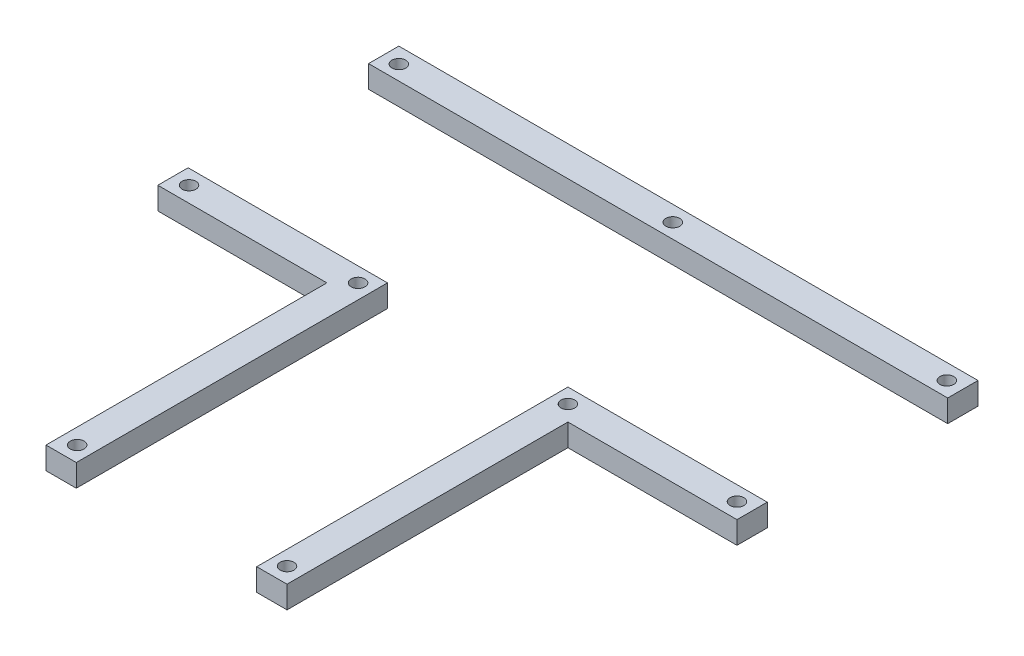
ISO-10303-21;
HEADER;
FILE_DESCRIPTION(('STEP AP214'),'2;1');
FILE_NAME('part.step','',(''),(''),'','','');
FILE_SCHEMA(('AUTOMOTIVE_DESIGN { 1 0 10303 214 1 1 1 1 }'));
ENDSEC;
DATA;
#1=APPLICATION_CONTEXT('core data for automotive mechanical design processes');
#2=APPLICATION_PROTOCOL_DEFINITION('international standard','automotive_design',2000,#1);
#3=PRODUCT_CONTEXT('',#1,'mechanical');
#4=PRODUCT('Part','Part','',(#3));
#5=PRODUCT_RELATED_PRODUCT_CATEGORY('part','',(#4));
#6=PRODUCT_DEFINITION_FORMATION('','',#4);
#7=PRODUCT_DEFINITION_CONTEXT('part definition',#1,'design');
#8=PRODUCT_DEFINITION('design','',#6,#7);
#9=PRODUCT_DEFINITION_SHAPE('','',#8);
#10=(LENGTH_UNIT() NAMED_UNIT(*) SI_UNIT(.MILLI.,.METRE.));
#11=(NAMED_UNIT(*) PLANE_ANGLE_UNIT() SI_UNIT($,.RADIAN.));
#12=(NAMED_UNIT(*) SI_UNIT($,.STERADIAN.) SOLID_ANGLE_UNIT());
#13=UNCERTAINTY_MEASURE_WITH_UNIT(LENGTH_MEASURE(1.E-05),#10,'distance_accuracy_value','');
#14=(GEOMETRIC_REPRESENTATION_CONTEXT(3) GLOBAL_UNCERTAINTY_ASSIGNED_CONTEXT((#13)) GLOBAL_UNIT_ASSIGNED_CONTEXT((#10,
#11,#12)) REPRESENTATION_CONTEXT('',''));
#15=CARTESIAN_POINT('',(0.,0.,0.));
#16=DIRECTION('',(0.,0.,1.));
#17=DIRECTION('',(1.,0.,0.));
#18=AXIS2_PLACEMENT_3D('',#15,#16,#17);
#19=CARTESIAN_POINT('',(0.,5.,0.));
#20=DIRECTION('',(0.,1.,0.));
#21=DIRECTION('',(0.,0.,1.));
#22=AXIS2_PLACEMENT_3D('',#19,#20,#21);
#23=PLANE('',#22);
#24=CARTESIAN_POINT('',(41.0708411698911,5.,62.4640845080096));
#25=DIRECTION('',(0.,-1.,0.));
#26=DIRECTION('',(0.,0.,1.));
#27=AXIS2_PLACEMENT_3D('',#24,#25,#26);
#28=CIRCLE('',#27,1.54999999999999);
#29=CARTESIAN_POINT('',(41.0708411698911,5.,64.0140845080096));
#30=VERTEX_POINT('',#29);
#31=EDGE_CURVE('E160',#30,#30,#28,.T.);
#32=ORIENTED_EDGE('',*,*,#31,.T.);
#33=EDGE_LOOP('',(#32));
#34=FACE_BOUND('',#33,.T.);
#35=CARTESIAN_POINT('',(79.0208411698913,5.,62.4640845080096));
#36=DIRECTION('',(0.,-1.,0.));
#37=DIRECTION('',(0.,0.,1.));
#38=AXIS2_PLACEMENT_3D('',#35,#36,#37);
#39=CIRCLE('',#38,1.55);
#40=CARTESIAN_POINT('',(79.0208411698913,5.,64.0140845080096));
#41=VERTEX_POINT('',#40);
#42=EDGE_CURVE('E170',#41,#41,#39,.T.);
#43=ORIENTED_EDGE('',*,*,#42,.T.);
#44=EDGE_LOOP('',(#43));
#45=FACE_BOUND('',#44,.T.);
#46=CARTESIAN_POINT('',(41.0708411698911,5.,125.51408450801));
#47=DIRECTION('',(0.,-1.,0.));
#48=DIRECTION('',(0.,0.,1.));
#49=AXIS2_PLACEMENT_3D('',#46,#47,#48);
#50=CIRCLE('',#49,1.54999999999999);
#51=CARTESIAN_POINT('',(41.0708411698911,5.,127.06408450801));
#52=VERTEX_POINT('',#51);
#53=EDGE_CURVE('E176',#52,#52,#50,.T.);
#54=ORIENTED_EDGE('',*,*,#53,.T.);
#55=EDGE_LOOP('',(#54));
#56=FACE_BOUND('',#55,.T.);
#57=DIRECTION('',(0.,0.,-1.));
#58=VECTOR('',#57,1.);
#59=CARTESIAN_POINT('',(82.5208411698908,5.,65.9640845080096));
#60=LINE('',#59,#58);
#61=CARTESIAN_POINT('',(82.5208411698908,5.,65.9640845080096));
#62=VERTEX_POINT('',#61);
#63=CARTESIAN_POINT('',(82.5208411698908,5.,59.1640845080096));
#64=VERTEX_POINT('',#63);
#65=EDGE_CURVE('E139',#62,#64,#60,.T.);
#66=ORIENTED_EDGE('',*,*,#65,.T.);
#67=DIRECTION('',(1.,0.,0.));
#68=VECTOR('',#67,1.);
#69=CARTESIAN_POINT('',(82.5208411698908,5.,59.1640845080096));
#70=LINE('',#69,#68);
#71=CARTESIAN_POINT('',(37.7708411698911,5.,59.1640845080096));
#72=VERTEX_POINT('',#71);
#73=EDGE_CURVE('E116',#72,#64,#70,.T.);
#74=ORIENTED_EDGE('',*,*,#73,.F.);
#75=DIRECTION('',(0.,0.,-1.));
#76=VECTOR('',#75,1.);
#77=CARTESIAN_POINT('',(37.7708411698911,5.,58.9640845080096));
#78=LINE('',#77,#76);
#79=CARTESIAN_POINT('',(37.7708411698911,5.,129.01408450801));
#80=VERTEX_POINT('',#79);
#81=EDGE_CURVE('E152',#80,#72,#78,.T.);
#82=ORIENTED_EDGE('',*,*,#81,.F.);
#83=DIRECTION('',(1.,0.,0.));
#84=VECTOR('',#83,1.);
#85=CARTESIAN_POINT('',(37.5708411698911,5.,129.01408450801));
#86=LINE('',#85,#84);
#87=CARTESIAN_POINT('',(44.5708411698911,5.,129.01408450801));
#88=VERTEX_POINT('',#87);
#89=EDGE_CURVE('E55',#80,#88,#86,.T.);
#90=ORIENTED_EDGE('',*,*,#89,.T.);
#91=DIRECTION('',(0.,0.,-1.));
#92=VECTOR('',#91,1.);
#93=CARTESIAN_POINT('',(44.5708411698911,5.,129.01408450801));
#94=LINE('',#93,#92);
#95=CARTESIAN_POINT('',(44.5708411698911,5.,65.9640845080096));
#96=VERTEX_POINT('',#95);
#97=EDGE_CURVE('E134',#88,#96,#94,.T.);
#98=ORIENTED_EDGE('',*,*,#97,.T.);
#99=DIRECTION('',(1.,0.,0.));
#100=VECTOR('',#99,1.);
#101=CARTESIAN_POINT('',(44.5708411698911,5.,65.9640845080096));
#102=LINE('',#101,#100);
#103=EDGE_CURVE('E141',#96,#62,#102,.T.);
#104=ORIENTED_EDGE('',*,*,#103,.T.);
#105=EDGE_LOOP('',(#66,#74,#82,#90,#98,#104));
#106=FACE_BOUND('',#105,.T.);
#107=ADVANCED_FACE('F52',(#34,#45,#56,#106),#23,.T.);
#108=CARTESIAN_POINT('',(0.,0.,0.));
#109=DIRECTION('',(0.,1.,0.));
#110=DIRECTION('',(0.,0.,1.));
#111=AXIS2_PLACEMENT_3D('',#108,#109,#110);
#112=PLANE('',#111);
#113=CARTESIAN_POINT('',(41.0708411698911,0.,62.4640845080096));
#114=DIRECTION('',(0.,-1.,0.));
#115=DIRECTION('',(0.,0.,1.));
#116=AXIS2_PLACEMENT_3D('',#113,#114,#115);
#117=CIRCLE('',#116,1.54999999999999);
#118=CARTESIAN_POINT('',(41.0708411698911,0.,64.0140845080096));
#119=VERTEX_POINT('',#118);
#120=EDGE_CURVE('E157',#119,#119,#117,.F.);
#121=ORIENTED_EDGE('',*,*,#120,.T.);
#122=EDGE_LOOP('',(#121));
#123=FACE_BOUND('',#122,.T.);
#124=CARTESIAN_POINT('',(79.0208411698913,0.,62.4640845080096));
#125=DIRECTION('',(0.,-1.,0.));
#126=DIRECTION('',(0.,0.,1.));
#127=AXIS2_PLACEMENT_3D('',#124,#125,#126);
#128=CIRCLE('',#127,1.55);
#129=CARTESIAN_POINT('',(79.0208411698913,0.,64.0140845080096));
#130=VERTEX_POINT('',#129);
#131=EDGE_CURVE('E167',#130,#130,#128,.F.);
#132=ORIENTED_EDGE('',*,*,#131,.T.);
#133=EDGE_LOOP('',(#132));
#134=FACE_BOUND('',#133,.T.);
#135=CARTESIAN_POINT('',(41.0708411698911,0.,125.51408450801));
#136=DIRECTION('',(0.,-1.,0.));
#137=DIRECTION('',(0.,0.,1.));
#138=AXIS2_PLACEMENT_3D('',#135,#136,#137);
#139=CIRCLE('',#138,1.54999999999999);
#140=CARTESIAN_POINT('',(41.0708411698911,0.,127.06408450801));
#141=VERTEX_POINT('',#140);
#142=EDGE_CURVE('E173',#141,#141,#139,.F.);
#143=ORIENTED_EDGE('',*,*,#142,.T.);
#144=EDGE_LOOP('',(#143));
#145=FACE_BOUND('',#144,.T.);
#146=DIRECTION('',(-1.,0.,0.));
#147=VECTOR('',#146,1.);
#148=CARTESIAN_POINT('',(82.5208411698908,0.,59.1640845080096));
#149=LINE('',#148,#147);
#150=CARTESIAN_POINT('',(82.5208411698908,0.,59.1640845080096));
#151=VERTEX_POINT('',#150);
#152=CARTESIAN_POINT('',(37.7708411698911,0.,59.1640845080096));
#153=VERTEX_POINT('',#152);
#154=EDGE_CURVE('E68',#151,#153,#149,.T.);
#155=ORIENTED_EDGE('',*,*,#154,.F.);
#156=DIRECTION('',(0.,0.,-1.));
#157=VECTOR('',#156,1.);
#158=CARTESIAN_POINT('',(82.5208411698908,0.,65.9640845080096));
#159=LINE('',#158,#157);
#160=CARTESIAN_POINT('',(82.5208411698908,0.,65.9640845080096));
#161=VERTEX_POINT('',#160);
#162=EDGE_CURVE('E126',#161,#151,#159,.T.);
#163=ORIENTED_EDGE('',*,*,#162,.F.);
#164=DIRECTION('',(1.,0.,0.));
#165=VECTOR('',#164,1.);
#166=CARTESIAN_POINT('',(44.5708411698911,0.,65.9640845080096));
#167=LINE('',#166,#165);
#168=CARTESIAN_POINT('',(44.5708411698911,0.,65.9640845080096));
#169=VERTEX_POINT('',#168);
#170=EDGE_CURVE('E98',#169,#161,#167,.T.);
#171=ORIENTED_EDGE('',*,*,#170,.F.);
#172=DIRECTION('',(0.,0.,-1.));
#173=VECTOR('',#172,1.);
#174=CARTESIAN_POINT('',(44.5708411698911,0.,129.01408450801));
#175=LINE('',#174,#173);
#176=CARTESIAN_POINT('',(44.5708411698911,0.,129.01408450801));
#177=VERTEX_POINT('',#176);
#178=EDGE_CURVE('E60',#177,#169,#175,.T.);
#179=ORIENTED_EDGE('',*,*,#178,.F.);
#180=DIRECTION('',(1.,0.,0.));
#181=VECTOR('',#180,1.);
#182=CARTESIAN_POINT('',(37.5708411698911,0.,129.01408450801));
#183=LINE('',#182,#181);
#184=CARTESIAN_POINT('',(37.7708411698911,0.,129.01408450801));
#185=VERTEX_POINT('',#184);
#186=EDGE_CURVE('E12',#185,#177,#183,.T.);
#187=ORIENTED_EDGE('',*,*,#186,.F.);
#188=DIRECTION('',(0.,0.,1.));
#189=VECTOR('',#188,1.);
#190=CARTESIAN_POINT('',(37.7708411698911,0.,58.9640845080096));
#191=LINE('',#190,#189);
#192=EDGE_CURVE('E127',#153,#185,#191,.T.);
#193=ORIENTED_EDGE('',*,*,#192,.F.);
#194=EDGE_LOOP('',(#155,#163,#171,#179,#187,#193));
#195=FACE_BOUND('',#194,.T.);
#196=ADVANCED_FACE('F125',(#123,#134,#145,#195),#112,.F.);
#197=CARTESIAN_POINT('',(82.5208411698908,5.,65.9640845080096));
#198=DIRECTION('',(-1.,0.,0.));
#199=DIRECTION('',(0.,0.,1.));
#200=AXIS2_PLACEMENT_3D('',#197,#198,#199);
#201=PLANE('',#200);
#202=DIRECTION('',(0.,-1.,0.));
#203=VECTOR('',#202,1.);
#204=CARTESIAN_POINT('',(82.5208411698908,5.,59.1640845080096));
#205=LINE('',#204,#203);
#206=EDGE_CURVE('E113',#64,#151,#205,.T.);
#207=ORIENTED_EDGE('',*,*,#206,.F.);
#208=ORIENTED_EDGE('',*,*,#65,.F.);
#209=DIRECTION('',(0.,-1.,0.));
#210=VECTOR('',#209,1.);
#211=CARTESIAN_POINT('',(82.5208411698908,5.,65.9640845080096));
#212=LINE('',#211,#210);
#213=EDGE_CURVE('E131',#62,#161,#212,.T.);
#214=ORIENTED_EDGE('',*,*,#213,.T.);
#215=ORIENTED_EDGE('',*,*,#162,.T.);
#216=EDGE_LOOP('',(#207,#208,#214,#215));
#217=FACE_BOUND('',#216,.T.);
#218=ADVANCED_FACE('F130',(#217),#201,.F.);
#219=CARTESIAN_POINT('',(37.770841169891,0.,0.));
#220=DIRECTION('',(-1.,0.,0.));
#221=DIRECTION('',(0.,0.,1.));
#222=AXIS2_PLACEMENT_3D('',#219,#220,#221);
#223=PLANE('',#222);
#224=ORIENTED_EDGE('',*,*,#81,.T.);
#225=DIRECTION('',(0.,1.,0.));
#226=VECTOR('',#225,1.);
#227=CARTESIAN_POINT('',(37.7708411698911,5.,59.1640845080096));
#228=LINE('',#227,#226);
#229=EDGE_CURVE('E128',#153,#72,#228,.T.);
#230=ORIENTED_EDGE('',*,*,#229,.F.);
#231=ORIENTED_EDGE('',*,*,#192,.T.);
#232=DIRECTION('',(0.,1.,0.));
#233=VECTOR('',#232,1.);
#234=CARTESIAN_POINT('',(37.7708411698911,5.,129.01408450801));
#235=LINE('',#234,#233);
#236=EDGE_CURVE('E156',#185,#80,#235,.T.);
#237=ORIENTED_EDGE('',*,*,#236,.T.);
#238=EDGE_LOOP('',(#224,#230,#231,#237));
#239=FACE_BOUND('',#238,.T.);
#240=ADVANCED_FACE('F155',(#239),#223,.T.);
#241=CARTESIAN_POINT('',(37.5708411698911,5.,129.01408450801));
#242=DIRECTION('',(0.,0.,-1.));
#243=DIRECTION('',(-1.,0.,0.));
#244=AXIS2_PLACEMENT_3D('',#241,#242,#243);
#245=PLANE('',#244);
#246=ORIENTED_EDGE('',*,*,#236,.F.);
#247=ORIENTED_EDGE('',*,*,#186,.T.);
#248=DIRECTION('',(0.,-1.,0.));
#249=VECTOR('',#248,1.);
#250=CARTESIAN_POINT('',(44.5708411698911,5.,129.01408450801));
#251=LINE('',#250,#249);
#252=EDGE_CURVE('E149',#88,#177,#251,.T.);
#253=ORIENTED_EDGE('',*,*,#252,.F.);
#254=ORIENTED_EDGE('',*,*,#89,.F.);
#255=EDGE_LOOP('',(#246,#247,#253,#254));
#256=FACE_BOUND('',#255,.T.);
#257=ADVANCED_FACE('F179',(#256),#245,.F.);
#258=CARTESIAN_POINT('',(44.5708411698911,5.,129.01408450801));
#259=DIRECTION('',(-1.,0.,0.));
#260=DIRECTION('',(0.,0.,1.));
#261=AXIS2_PLACEMENT_3D('',#258,#259,#260);
#262=PLANE('',#261);
#263=ORIENTED_EDGE('',*,*,#178,.T.);
#264=DIRECTION('',(0.,-1.,0.));
#265=VECTOR('',#264,1.);
#266=CARTESIAN_POINT('',(44.5708411698911,5.,65.9640845080096));
#267=LINE('',#266,#265);
#268=EDGE_CURVE('E146',#96,#169,#267,.T.);
#269=ORIENTED_EDGE('',*,*,#268,.F.);
#270=ORIENTED_EDGE('',*,*,#97,.F.);
#271=ORIENTED_EDGE('',*,*,#252,.T.);
#272=EDGE_LOOP('',(#263,#269,#270,#271));
#273=FACE_BOUND('',#272,.T.);
#274=ADVANCED_FACE('F147',(#273),#262,.F.);
#275=CARTESIAN_POINT('',(44.5708411698911,5.,65.9640845080096));
#276=DIRECTION('',(0.,0.,-1.));
#277=DIRECTION('',(-1.,0.,0.));
#278=AXIS2_PLACEMENT_3D('',#275,#276,#277);
#279=PLANE('',#278);
#280=ORIENTED_EDGE('',*,*,#170,.T.);
#281=ORIENTED_EDGE('',*,*,#213,.F.);
#282=ORIENTED_EDGE('',*,*,#103,.F.);
#283=ORIENTED_EDGE('',*,*,#268,.T.);
#284=EDGE_LOOP('',(#280,#281,#282,#283));
#285=FACE_BOUND('',#284,.T.);
#286=ADVANCED_FACE('F150',(#285),#279,.F.);
#287=CARTESIAN_POINT('',(41.0708411698911,-4.3840620433566,125.51408450801));
#288=DIRECTION('',(0.,1.,0.));
#289=DIRECTION('',(0.,0.,1.));
#290=AXIS2_PLACEMENT_3D('',#287,#288,#289);
#291=CYLINDRICAL_SURFACE('',#290,1.54999999999999);
#292=ORIENTED_EDGE('',*,*,#142,.F.);
#293=EDGE_LOOP('',(#292));
#294=FACE_BOUND('',#293,.T.);
#295=ORIENTED_EDGE('',*,*,#53,.F.);
#296=EDGE_LOOP('',(#295));
#297=FACE_BOUND('',#296,.T.);
#298=ADVANCED_FACE('F201',(#294,#297),#291,.F.);
#299=CARTESIAN_POINT('',(79.0208411698913,-4.3840620433566,62.4640845080096));
#300=DIRECTION('',(0.,1.,0.));
#301=DIRECTION('',(0.,0.,1.));
#302=AXIS2_PLACEMENT_3D('',#299,#300,#301);
#303=CYLINDRICAL_SURFACE('',#302,1.55);
#304=ORIENTED_EDGE('',*,*,#131,.F.);
#305=EDGE_LOOP('',(#304));
#306=FACE_BOUND('',#305,.T.);
#307=ORIENTED_EDGE('',*,*,#42,.F.);
#308=EDGE_LOOP('',(#307));
#309=FACE_BOUND('',#308,.T.);
#310=ADVANCED_FACE('F203',(#306,#309),#303,.F.);
#311=CARTESIAN_POINT('',(41.0708411698911,-4.3840620433566,62.4640845080096));
#312=DIRECTION('',(0.,1.,0.));
#313=DIRECTION('',(0.,0.,1.));
#314=AXIS2_PLACEMENT_3D('',#311,#312,#313);
#315=CYLINDRICAL_SURFACE('',#314,1.54999999999999);
#316=ORIENTED_EDGE('',*,*,#120,.F.);
#317=EDGE_LOOP('',(#316));
#318=FACE_BOUND('',#317,.T.);
#319=ORIENTED_EDGE('',*,*,#31,.F.);
#320=EDGE_LOOP('',(#319));
#321=FACE_BOUND('',#320,.T.);
#322=ADVANCED_FACE('F209',(#318,#321),#315,.F.);
#323=CARTESIAN_POINT('',(0.,0.,59.1640845080096));
#324=DIRECTION('',(0.,0.,-1.));
#325=DIRECTION('',(-1.,0.,0.));
#326=AXIS2_PLACEMENT_3D('',#323,#324,#325);
#327=PLANE('',#326);
#328=ORIENTED_EDGE('',*,*,#206,.T.);
#329=ORIENTED_EDGE('',*,*,#154,.T.);
#330=ORIENTED_EDGE('',*,*,#229,.T.);
#331=ORIENTED_EDGE('',*,*,#73,.T.);
#332=EDGE_LOOP('',(#328,#329,#330,#331));
#333=FACE_BOUND('',#332,.T.);
#334=ADVANCED_FACE('F114',(#333),#327,.T.);
#335=CLOSED_SHELL('',(#107,#196,#218,#240,#257,#274,#286,#298,#310,#322,#334));
#336=MANIFOLD_SOLID_BREP('B2',#335);
#337=CARTESIAN_POINT('',(-47.4791588301092,5.,11.8640845080096));
#338=DIRECTION('',(1.,0.,0.));
#339=DIRECTION('',(0.,0.,-1.));
#340=AXIS2_PLACEMENT_3D('',#337,#338,#339);
#341=PLANE('',#340);
#342=DIRECTION('',(0.,-1.,0.));
#343=VECTOR('',#342,1.);
#344=CARTESIAN_POINT('',(-47.4791588301092,5.,18.6640845080096));
#345=LINE('',#344,#343);
#346=CARTESIAN_POINT('',(-47.4791588301092,5.,18.6640845080096));
#347=VERTEX_POINT('',#346);
#348=CARTESIAN_POINT('',(-47.4791588301092,0.,18.6640845080096));
#349=VERTEX_POINT('',#348);
#350=EDGE_CURVE('E339',#347,#349,#345,.T.);
#351=ORIENTED_EDGE('',*,*,#350,.F.);
#352=DIRECTION('',(0.,0.,1.));
#353=VECTOR('',#352,1.);
#354=CARTESIAN_POINT('',(-47.4791588301092,5.,11.8640845080096));
#355=LINE('',#354,#353);
#356=CARTESIAN_POINT('',(-47.4791588301092,5.,11.8640845080096));
#357=VERTEX_POINT('',#356);
#358=EDGE_CURVE('E359',#357,#347,#355,.T.);
#359=ORIENTED_EDGE('',*,*,#358,.F.);
#360=DIRECTION('',(0.,-1.,0.));
#361=VECTOR('',#360,1.);
#362=CARTESIAN_POINT('',(-47.4791588301092,5.,11.8640845080096));
#363=LINE('',#362,#361);
#364=CARTESIAN_POINT('',(-47.4791588301092,0.,11.8640845080096));
#365=VERTEX_POINT('',#364);
#366=EDGE_CURVE('E362',#357,#365,#363,.T.);
#367=ORIENTED_EDGE('',*,*,#366,.T.);
#368=DIRECTION('',(0.,0.,1.));
#369=VECTOR('',#368,1.);
#370=CARTESIAN_POINT('',(-47.4791588301092,0.,11.8640845080096));
#371=LINE('',#370,#369);
#372=EDGE_CURVE('E331',#365,#349,#371,.T.);
#373=ORIENTED_EDGE('',*,*,#372,.T.);
#374=EDGE_LOOP('',(#351,#359,#367,#373));
#375=FACE_BOUND('',#374,.T.);
#376=ADVANCED_FACE('F322',(#375),#341,.F.);
#377=CARTESIAN_POINT('',(82.5208411698908,5.,18.8640845080096));
#378=DIRECTION('',(-1.,0.,0.));
#379=DIRECTION('',(0.,0.,1.));
#380=AXIS2_PLACEMENT_3D('',#377,#378,#379);
#381=PLANE('',#380);
#382=DIRECTION('',(0.,1.,0.));
#383=VECTOR('',#382,1.);
#384=CARTESIAN_POINT('',(82.5208411698908,5.,18.6640845080096));
#385=LINE('',#384,#383);
#386=CARTESIAN_POINT('',(82.5208411698908,0.,18.6640845080096));
#387=VERTEX_POINT('',#386);
#388=CARTESIAN_POINT('',(82.5208411698908,5.,18.6640845080096));
#389=VERTEX_POINT('',#388);
#390=EDGE_CURVE('E390',#387,#389,#385,.T.);
#391=ORIENTED_EDGE('',*,*,#390,.F.);
#392=DIRECTION('',(0.,0.,-1.));
#393=VECTOR('',#392,1.);
#394=CARTESIAN_POINT('',(82.5208411698908,0.,18.8640845080096));
#395=LINE('',#394,#393);
#396=CARTESIAN_POINT('',(82.5208411698908,0.,11.8640845080096));
#397=VERTEX_POINT('',#396);
#398=EDGE_CURVE('E371',#387,#397,#395,.T.);
#399=ORIENTED_EDGE('',*,*,#398,.T.);
#400=DIRECTION('',(0.,-1.,0.));
#401=VECTOR('',#400,1.);
#402=CARTESIAN_POINT('',(82.5208411698908,5.,11.8640845080096));
#403=LINE('',#402,#401);
#404=CARTESIAN_POINT('',(82.5208411698908,5.,11.8640845080096));
#405=VERTEX_POINT('',#404);
#406=EDGE_CURVE('E373',#405,#397,#403,.T.);
#407=ORIENTED_EDGE('',*,*,#406,.F.);
#408=DIRECTION('',(0.,0.,-1.));
#409=VECTOR('',#408,1.);
#410=CARTESIAN_POINT('',(82.5208411698908,5.,18.8640845080096));
#411=LINE('',#410,#409);
#412=EDGE_CURVE('E365',#389,#405,#411,.T.);
#413=ORIENTED_EDGE('',*,*,#412,.F.);
#414=EDGE_LOOP('',(#391,#399,#407,#413));
#415=FACE_BOUND('',#414,.T.);
#416=ADVANCED_FACE('F387',(#415),#381,.F.);
#417=CARTESIAN_POINT('',(0.,5.,0.));
#418=DIRECTION('',(0.,1.,0.));
#419=DIRECTION('',(0.,0.,1.));
#420=AXIS2_PLACEMENT_3D('',#417,#418,#419);
#421=PLANE('',#420);
#422=CARTESIAN_POINT('',(17.5208411698908,5.,15.3640845080096));
#423=DIRECTION('',(0.,1.,0.));
#424=DIRECTION('',(0.,0.,1.));
#425=AXIS2_PLACEMENT_3D('',#422,#423,#424);
#426=CIRCLE('',#425,1.55);
#427=CARTESIAN_POINT('',(17.5208411698908,5.,16.9140845080096));
#428=VERTEX_POINT('',#427);
#429=EDGE_CURVE('E498',#428,#428,#426,.T.);
#430=ORIENTED_EDGE('',*,*,#429,.F.);
#431=EDGE_LOOP('',(#430));
#432=FACE_BOUND('',#431,.T.);
#433=CARTESIAN_POINT('',(79.0208411698913,5.,15.3640845080096));
#434=DIRECTION('',(0.,-1.,0.));
#435=DIRECTION('',(0.,0.,1.));
#436=AXIS2_PLACEMENT_3D('',#433,#434,#435);
#437=CIRCLE('',#436,1.55);
#438=CARTESIAN_POINT('',(79.0208411698913,5.,16.9140845080096));
#439=VERTEX_POINT('',#438);
#440=EDGE_CURVE('E508',#439,#439,#437,.T.);
#441=ORIENTED_EDGE('',*,*,#440,.T.);
#442=EDGE_LOOP('',(#441));
#443=FACE_BOUND('',#442,.T.);
#444=CARTESIAN_POINT('',(-43.9791588301092,5.,15.3640845080096));
#445=DIRECTION('',(0.,1.,0.));
#446=DIRECTION('',(0.,0.,1.));
#447=AXIS2_PLACEMENT_3D('',#444,#445,#446);
#448=CIRCLE('',#447,1.55);
#449=CARTESIAN_POINT('',(-43.9791588301092,5.,16.9140845080096));
#450=VERTEX_POINT('',#449);
#451=EDGE_CURVE('E374',#450,#450,#448,.T.);
#452=ORIENTED_EDGE('',*,*,#451,.F.);
#453=EDGE_LOOP('',(#452));
#454=FACE_BOUND('',#453,.T.);
#455=ORIENTED_EDGE('',*,*,#358,.T.);
#456=DIRECTION('',(-1.,0.,0.));
#457=VECTOR('',#456,1.);
#458=CARTESIAN_POINT('',(-47.4791588301092,5.,18.6640845080096));
#459=LINE('',#458,#457);
#460=EDGE_CURVE('E499',#389,#347,#459,.T.);
#461=ORIENTED_EDGE('',*,*,#460,.F.);
#462=ORIENTED_EDGE('',*,*,#412,.T.);
#463=DIRECTION('',(-1.,0.,0.));
#464=VECTOR('',#463,1.);
#465=CARTESIAN_POINT('',(82.5208411698908,5.,11.8640845080096));
#466=LINE('',#465,#464);
#467=EDGE_CURVE('E326',#405,#357,#466,.T.);
#468=ORIENTED_EDGE('',*,*,#467,.T.);
#469=EDGE_LOOP('',(#455,#461,#462,#468));
#470=FACE_BOUND('',#469,.T.);
#471=ADVANCED_FACE('F324',(#432,#443,#454,#470),#421,.T.);
#472=CARTESIAN_POINT('',(0.,0.,0.));
#473=DIRECTION('',(0.,1.,0.));
#474=DIRECTION('',(0.,0.,1.));
#475=AXIS2_PLACEMENT_3D('',#472,#473,#474);
#476=PLANE('',#475);
#477=CARTESIAN_POINT('',(-43.9791588301092,0.,15.3640845080096));
#478=DIRECTION('',(0.,1.,0.));
#479=DIRECTION('',(0.,0.,1.));
#480=AXIS2_PLACEMENT_3D('',#477,#478,#479);
#481=CIRCLE('',#480,1.55);
#482=CARTESIAN_POINT('',(-43.9791588301092,0.,16.9140845080096));
#483=VERTEX_POINT('',#482);
#484=EDGE_CURVE('E378',#483,#483,#481,.F.);
#485=ORIENTED_EDGE('',*,*,#484,.F.);
#486=EDGE_LOOP('',(#485));
#487=FACE_BOUND('',#486,.T.);
#488=CARTESIAN_POINT('',(79.0208411698913,0.,15.3640845080096));
#489=DIRECTION('',(0.,-1.,0.));
#490=DIRECTION('',(0.,0.,1.));
#491=AXIS2_PLACEMENT_3D('',#488,#489,#490);
#492=CIRCLE('',#491,1.55);
#493=CARTESIAN_POINT('',(79.0208411698913,0.,16.9140845080096));
#494=VERTEX_POINT('',#493);
#495=EDGE_CURVE('E501',#494,#494,#492,.F.);
#496=ORIENTED_EDGE('',*,*,#495,.T.);
#497=EDGE_LOOP('',(#496));
#498=FACE_BOUND('',#497,.T.);
#499=CARTESIAN_POINT('',(17.5208411698908,0.,15.3640845080096));
#500=DIRECTION('',(0.,1.,0.));
#501=DIRECTION('',(0.,0.,1.));
#502=AXIS2_PLACEMENT_3D('',#499,#500,#501);
#503=CIRCLE('',#502,1.55);
#504=CARTESIAN_POINT('',(17.5208411698908,0.,16.9140845080096));
#505=VERTEX_POINT('',#504);
#506=EDGE_CURVE('E495',#505,#505,#503,.F.);
#507=ORIENTED_EDGE('',*,*,#506,.F.);
#508=EDGE_LOOP('',(#507));
#509=FACE_BOUND('',#508,.T.);
#510=DIRECTION('',(1.,0.,0.));
#511=VECTOR('',#510,1.);
#512=CARTESIAN_POINT('',(-47.4791588301092,0.,18.6640845080096));
#513=LINE('',#512,#511);
#514=EDGE_CURVE('E392',#349,#387,#513,.T.);
#515=ORIENTED_EDGE('',*,*,#514,.F.);
#516=ORIENTED_EDGE('',*,*,#372,.F.);
#517=DIRECTION('',(-1.,0.,0.));
#518=VECTOR('',#517,1.);
#519=CARTESIAN_POINT('',(82.5208411698908,0.,11.8640845080096));
#520=LINE('',#519,#518);
#521=EDGE_CURVE('E50',#397,#365,#520,.T.);
#522=ORIENTED_EDGE('',*,*,#521,.F.);
#523=ORIENTED_EDGE('',*,*,#398,.F.);
#524=EDGE_LOOP('',(#515,#516,#522,#523));
#525=FACE_BOUND('',#524,.T.);
#526=ADVANCED_FACE('F391',(#487,#498,#509,#525),#476,.F.);
#527=CARTESIAN_POINT('',(82.5208411698908,5.,11.8640845080096));
#528=DIRECTION('',(0.,0.,1.));
#529=DIRECTION('',(1.,0.,0.));
#530=AXIS2_PLACEMENT_3D('',#527,#528,#529);
#531=PLANE('',#530);
#532=ORIENTED_EDGE('',*,*,#521,.T.);
#533=ORIENTED_EDGE('',*,*,#366,.F.);
#534=ORIENTED_EDGE('',*,*,#467,.F.);
#535=ORIENTED_EDGE('',*,*,#406,.T.);
#536=EDGE_LOOP('',(#532,#533,#534,#535));
#537=FACE_BOUND('',#536,.T.);
#538=ADVANCED_FACE('F372',(#537),#531,.F.);
#539=CARTESIAN_POINT('',(-43.9791588301092,-4.3840620433566,15.3640845080096));
#540=DIRECTION('',(0.,1.,0.));
#541=DIRECTION('',(0.,0.,1.));
#542=AXIS2_PLACEMENT_3D('',#539,#540,#541);
#543=CYLINDRICAL_SURFACE('',#542,1.55);
#544=ORIENTED_EDGE('',*,*,#484,.T.);
#545=EDGE_LOOP('',(#544));
#546=FACE_BOUND('',#545,.T.);
#547=ORIENTED_EDGE('',*,*,#451,.T.);
#548=EDGE_LOOP('',(#547));
#549=FACE_BOUND('',#548,.T.);
#550=ADVANCED_FACE('F399',(#546,#549),#543,.F.);
#551=CARTESIAN_POINT('',(79.0208411698913,-4.3840620433566,15.3640845080096));
#552=DIRECTION('',(0.,1.,0.));
#553=DIRECTION('',(0.,0.,1.));
#554=AXIS2_PLACEMENT_3D('',#551,#552,#553);
#555=CYLINDRICAL_SURFACE('',#554,1.55);
#556=ORIENTED_EDGE('',*,*,#495,.F.);
#557=EDGE_LOOP('',(#556));
#558=FACE_BOUND('',#557,.T.);
#559=ORIENTED_EDGE('',*,*,#440,.F.);
#560=EDGE_LOOP('',(#559));
#561=FACE_BOUND('',#560,.T.);
#562=ADVANCED_FACE('F413',(#558,#561),#555,.F.);
#563=CARTESIAN_POINT('',(17.5208411698908,-4.3840620433566,15.3640845080096));
#564=DIRECTION('',(0.,1.,0.));
#565=DIRECTION('',(0.,0.,1.));
#566=AXIS2_PLACEMENT_3D('',#563,#564,#565);
#567=CYLINDRICAL_SURFACE('',#566,1.55);
#568=ORIENTED_EDGE('',*,*,#506,.T.);
#569=EDGE_LOOP('',(#568));
#570=FACE_BOUND('',#569,.T.);
#571=ORIENTED_EDGE('',*,*,#429,.T.);
#572=EDGE_LOOP('',(#571));
#573=FACE_BOUND('',#572,.T.);
#574=ADVANCED_FACE('F417',(#570,#573),#567,.F.);
#575=CARTESIAN_POINT('',(0.,0.,18.6640845080096));
#576=DIRECTION('',(0.,0.,1.));
#577=DIRECTION('',(1.,0.,0.));
#578=AXIS2_PLACEMENT_3D('',#575,#576,#577);
#579=PLANE('',#578);
#580=ORIENTED_EDGE('',*,*,#350,.T.);
#581=ORIENTED_EDGE('',*,*,#514,.T.);
#582=ORIENTED_EDGE('',*,*,#390,.T.);
#583=ORIENTED_EDGE('',*,*,#460,.T.);
#584=EDGE_LOOP('',(#580,#581,#582,#583));
#585=FACE_BOUND('',#584,.T.);
#586=ADVANCED_FACE('F421',(#585),#579,.T.);
#587=CLOSED_SHELL('',(#376,#416,#471,#526,#538,#550,#562,#574,#586));
#588=MANIFOLD_SOLID_BREP('B6',#587);
#589=CARTESIAN_POINT('',(0.,5.,0.));
#590=DIRECTION('',(0.,1.,0.));
#591=DIRECTION('',(0.,0.,1.));
#592=AXIS2_PLACEMENT_3D('',#589,#590,#591);
#593=PLANE('',#592);
#594=CARTESIAN_POINT('',(-6.02915883010894,5.,125.51408450801));
#595=DIRECTION('',(0.,1.,0.));
#596=DIRECTION('',(0.,0.,1.));
#597=AXIS2_PLACEMENT_3D('',#594,#595,#596);
#598=CIRCLE('',#597,1.54999999999999);
#599=CARTESIAN_POINT('',(-6.02915883010894,5.,127.06408450801));
#600=VERTEX_POINT('',#599);
#601=EDGE_CURVE('E603',#600,#600,#598,.T.);
#602=ORIENTED_EDGE('',*,*,#601,.F.);
#603=EDGE_LOOP('',(#602));
#604=FACE_BOUND('',#603,.T.);
#605=CARTESIAN_POINT('',(-6.02915883010894,5.,62.4640845080096));
#606=DIRECTION('',(0.,1.,0.));
#607=DIRECTION('',(0.,0.,1.));
#608=AXIS2_PLACEMENT_3D('',#605,#606,#607);
#609=CIRCLE('',#608,1.54999999999999);
#610=CARTESIAN_POINT('',(-6.02915883010894,5.,64.0140845080096));
#611=VERTEX_POINT('',#610);
#612=EDGE_CURVE('E607',#611,#611,#609,.T.);
#613=ORIENTED_EDGE('',*,*,#612,.F.);
#614=EDGE_LOOP('',(#613));
#615=FACE_BOUND('',#614,.T.);
#616=CARTESIAN_POINT('',(-43.9791588301092,5.,62.4640845080096));
#617=DIRECTION('',(0.,1.,0.));
#618=DIRECTION('',(0.,0.,1.));
#619=AXIS2_PLACEMENT_3D('',#616,#617,#618);
#620=CIRCLE('',#619,1.55);
#621=CARTESIAN_POINT('',(-43.9791588301092,5.,64.0140845080096));
#622=VERTEX_POINT('',#621);
#623=EDGE_CURVE('E613',#622,#622,#620,.T.);
#624=ORIENTED_EDGE('',*,*,#623,.F.);
#625=EDGE_LOOP('',(#624));
#626=FACE_BOUND('',#625,.T.);
#627=DIRECTION('',(0.,0.,1.));
#628=VECTOR('',#627,1.);
#629=CARTESIAN_POINT('',(-2.72915883010894,5.,129.01408450801));
#630=LINE('',#629,#628);
#631=CARTESIAN_POINT('',(-2.72915883010894,5.,59.1640845080096));
#632=VERTEX_POINT('',#631);
#633=CARTESIAN_POINT('',(-2.72915883010894,5.,129.01408450801));
#634=VERTEX_POINT('',#633);
#635=EDGE_CURVE('E596',#632,#634,#630,.T.);
#636=ORIENTED_EDGE('',*,*,#635,.F.);
#637=DIRECTION('',(1.,0.,0.));
#638=VECTOR('',#637,1.);
#639=CARTESIAN_POINT('',(-2.72915883010894,5.,59.1640845080096));
#640=LINE('',#639,#638);
#641=CARTESIAN_POINT('',(-47.4791588301092,5.,59.1640845080096));
#642=VERTEX_POINT('',#641);
#643=EDGE_CURVE('E542',#642,#632,#640,.T.);
#644=ORIENTED_EDGE('',*,*,#643,.F.);
#645=DIRECTION('',(0.,0.,1.));
#646=VECTOR('',#645,1.);
#647=CARTESIAN_POINT('',(-47.4791588301092,5.,58.9640845080096));
#648=LINE('',#647,#646);
#649=CARTESIAN_POINT('',(-47.4791588301092,5.,65.9640845080096));
#650=VERTEX_POINT('',#649);
#651=EDGE_CURVE('E620',#642,#650,#648,.T.);
#652=ORIENTED_EDGE('',*,*,#651,.T.);
#653=DIRECTION('',(1.,0.,0.));
#654=VECTOR('',#653,1.);
#655=CARTESIAN_POINT('',(-47.4791588301092,5.,65.9640845080096));
#656=LINE('',#655,#654);
#657=CARTESIAN_POINT('',(-9.52915883010895,5.,65.9640845080096));
#658=VERTEX_POINT('',#657);
#659=EDGE_CURVE('E622',#650,#658,#656,.T.);
#660=ORIENTED_EDGE('',*,*,#659,.T.);
#661=DIRECTION('',(0.,0.,1.));
#662=VECTOR('',#661,1.);
#663=CARTESIAN_POINT('',(-9.52915883010895,5.,65.9640845080096));
#664=LINE('',#663,#662);
#665=CARTESIAN_POINT('',(-9.52915883010894,5.,129.01408450801));
#666=VERTEX_POINT('',#665);
#667=EDGE_CURVE('E625',#658,#666,#664,.T.);
#668=ORIENTED_EDGE('',*,*,#667,.T.);
#669=DIRECTION('',(1.,0.,0.));
#670=VECTOR('',#669,1.);
#671=CARTESIAN_POINT('',(-9.52915883010894,5.,129.01408450801));
#672=LINE('',#671,#670);
#673=EDGE_CURVE('E627',#666,#634,#672,.T.);
#674=ORIENTED_EDGE('',*,*,#673,.T.);
#675=EDGE_LOOP('',(#636,#644,#652,#660,#668,#674));
#676=FACE_BOUND('',#675,.T.);
#677=ADVANCED_FACE('F527',(#604,#615,#626,#676),#593,.T.);
#678=CARTESIAN_POINT('',(0.,0.,0.));
#679=DIRECTION('',(0.,1.,0.));
#680=DIRECTION('',(0.,0.,1.));
#681=AXIS2_PLACEMENT_3D('',#678,#679,#680);
#682=PLANE('',#681);
#683=CARTESIAN_POINT('',(-6.02915883010894,0.,125.51408450801));
#684=DIRECTION('',(0.,1.,0.));
#685=DIRECTION('',(0.,0.,1.));
#686=AXIS2_PLACEMENT_3D('',#683,#684,#685);
#687=CIRCLE('',#686,1.54999999999999);
#688=CARTESIAN_POINT('',(-6.02915883010894,0.,127.06408450801));
#689=VERTEX_POINT('',#688);
#690=EDGE_CURVE('E606',#689,#689,#687,.F.);
#691=ORIENTED_EDGE('',*,*,#690,.F.);
#692=EDGE_LOOP('',(#691));
#693=FACE_BOUND('',#692,.T.);
#694=CARTESIAN_POINT('',(-6.02915883010894,0.,62.4640845080096));
#695=DIRECTION('',(0.,1.,0.));
#696=DIRECTION('',(0.,0.,1.));
#697=AXIS2_PLACEMENT_3D('',#694,#695,#696);
#698=CIRCLE('',#697,1.54999999999999);
#699=CARTESIAN_POINT('',(-6.02915883010894,0.,64.0140845080096));
#700=VERTEX_POINT('',#699);
#701=EDGE_CURVE('E610',#700,#700,#698,.F.);
#702=ORIENTED_EDGE('',*,*,#701,.F.);
#703=EDGE_LOOP('',(#702));
#704=FACE_BOUND('',#703,.T.);
#705=CARTESIAN_POINT('',(-43.9791588301092,0.,62.4640845080096));
#706=DIRECTION('',(0.,1.,0.));
#707=DIRECTION('',(0.,0.,1.));
#708=AXIS2_PLACEMENT_3D('',#705,#706,#707);
#709=CIRCLE('',#708,1.55);
#710=CARTESIAN_POINT('',(-43.9791588301092,0.,64.0140845080096));
#711=VERTEX_POINT('',#710);
#712=EDGE_CURVE('E598',#711,#711,#709,.F.);
#713=ORIENTED_EDGE('',*,*,#712,.F.);
#714=EDGE_LOOP('',(#713));
#715=FACE_BOUND('',#714,.T.);
#716=DIRECTION('',(-1.,0.,0.));
#717=VECTOR('',#716,1.);
#718=CARTESIAN_POINT('',(-2.72915883010894,0.,59.1640845080096));
#719=LINE('',#718,#717);
#720=CARTESIAN_POINT('',(-2.72915883010894,0.,59.1640845080096));
#721=VERTEX_POINT('',#720);
#722=CARTESIAN_POINT('',(-47.4791588301092,0.,59.1640845080096));
#723=VERTEX_POINT('',#722);
#724=EDGE_CURVE('E581',#721,#723,#719,.T.);
#725=ORIENTED_EDGE('',*,*,#724,.F.);
#726=DIRECTION('',(0.,0.,-1.));
#727=VECTOR('',#726,1.);
#728=CARTESIAN_POINT('',(-2.72915883010894,0.,129.01408450801));
#729=LINE('',#728,#727);
#730=CARTESIAN_POINT('',(-2.72915883010894,0.,129.01408450801));
#731=VERTEX_POINT('',#730);
#732=EDGE_CURVE('E589',#731,#721,#729,.T.);
#733=ORIENTED_EDGE('',*,*,#732,.F.);
#734=DIRECTION('',(1.,0.,0.));
#735=VECTOR('',#734,1.);
#736=CARTESIAN_POINT('',(-9.52915883010894,0.,129.01408450801));
#737=LINE('',#736,#735);
#738=CARTESIAN_POINT('',(-9.52915883010894,0.,129.01408450801));
#739=VERTEX_POINT('',#738);
#740=EDGE_CURVE('E623',#739,#731,#737,.T.);
#741=ORIENTED_EDGE('',*,*,#740,.F.);
#742=DIRECTION('',(0.,0.,1.));
#743=VECTOR('',#742,1.);
#744=CARTESIAN_POINT('',(-9.52915883010895,0.,65.9640845080096));
#745=LINE('',#744,#743);
#746=CARTESIAN_POINT('',(-9.52915883010895,0.,65.9640845080096));
#747=VERTEX_POINT('',#746);
#748=EDGE_CURVE('E634',#747,#739,#745,.T.);
#749=ORIENTED_EDGE('',*,*,#748,.F.);
#750=DIRECTION('',(1.,0.,0.));
#751=VECTOR('',#750,1.);
#752=CARTESIAN_POINT('',(-47.4791588301092,0.,65.9640845080096));
#753=LINE('',#752,#751);
#754=CARTESIAN_POINT('',(-47.4791588301092,0.,65.9640845080096));
#755=VERTEX_POINT('',#754);
#756=EDGE_CURVE('E632',#755,#747,#753,.T.);
#757=ORIENTED_EDGE('',*,*,#756,.F.);
#758=DIRECTION('',(0.,0.,1.));
#759=VECTOR('',#758,1.);
#760=CARTESIAN_POINT('',(-47.4791588301092,0.,58.9640845080096));
#761=LINE('',#760,#759);
#762=EDGE_CURVE('E592',#723,#755,#761,.T.);
#763=ORIENTED_EDGE('',*,*,#762,.F.);
#764=EDGE_LOOP('',(#725,#733,#741,#749,#757,#763));
#765=FACE_BOUND('',#764,.T.);
#766=ADVANCED_FACE('F587',(#693,#704,#715,#765),#682,.F.);
#767=CARTESIAN_POINT('',(-47.4791588301092,5.,58.9640845080096));
#768=DIRECTION('',(1.,0.,0.));
#769=DIRECTION('',(0.,0.,-1.));
#770=AXIS2_PLACEMENT_3D('',#767,#768,#769);
#771=PLANE('',#770);
#772=DIRECTION('',(0.,1.,0.));
#773=VECTOR('',#772,1.);
#774=CARTESIAN_POINT('',(-47.4791588301092,5.,59.1640845080096));
#775=LINE('',#774,#773);
#776=EDGE_CURVE('E593',#723,#642,#775,.T.);
#777=ORIENTED_EDGE('',*,*,#776,.F.);
#778=ORIENTED_EDGE('',*,*,#762,.T.);
#779=DIRECTION('',(0.,-1.,0.));
#780=VECTOR('',#779,1.);
#781=CARTESIAN_POINT('',(-47.4791588301092,5.,65.9640845080096));
#782=LINE('',#781,#780);
#783=EDGE_CURVE('E320',#650,#755,#782,.T.);
#784=ORIENTED_EDGE('',*,*,#783,.F.);
#785=ORIENTED_EDGE('',*,*,#651,.F.);
#786=EDGE_LOOP('',(#777,#778,#784,#785));
#787=FACE_BOUND('',#786,.T.);
#788=ADVANCED_FACE('F529',(#787),#771,.F.);
#789=CARTESIAN_POINT('',(-2.72915883010894,0.,0.));
#790=DIRECTION('',(1.,0.,0.));
#791=DIRECTION('',(0.,0.,-1.));
#792=AXIS2_PLACEMENT_3D('',#789,#790,#791);
#793=PLANE('',#792);
#794=ORIENTED_EDGE('',*,*,#732,.T.);
#795=DIRECTION('',(0.,-1.,0.));
#796=VECTOR('',#795,1.);
#797=CARTESIAN_POINT('',(-2.72915883010894,5.,59.1640845080096));
#798=LINE('',#797,#796);
#799=EDGE_CURVE('E578',#632,#721,#798,.T.);
#800=ORIENTED_EDGE('',*,*,#799,.F.);
#801=ORIENTED_EDGE('',*,*,#635,.T.);
#802=DIRECTION('',(0.,-1.,0.));
#803=VECTOR('',#802,1.);
#804=CARTESIAN_POINT('',(-2.72915883010894,5.,129.01408450801));
#805=LINE('',#804,#803);
#806=EDGE_CURVE('E550',#634,#731,#805,.T.);
#807=ORIENTED_EDGE('',*,*,#806,.T.);
#808=EDGE_LOOP('',(#794,#800,#801,#807));
#809=FACE_BOUND('',#808,.T.);
#810=ADVANCED_FACE('F595',(#809),#793,.T.);
#811=CARTESIAN_POINT('',(-9.52915883010894,5.,129.01408450801));
#812=DIRECTION('',(0.,0.,-1.));
#813=DIRECTION('',(-1.,0.,0.));
#814=AXIS2_PLACEMENT_3D('',#811,#812,#813);
#815=PLANE('',#814);
#816=ORIENTED_EDGE('',*,*,#806,.F.);
#817=ORIENTED_EDGE('',*,*,#673,.F.);
#818=DIRECTION('',(0.,-1.,0.));
#819=VECTOR('',#818,1.);
#820=CARTESIAN_POINT('',(-9.52915883010894,5.,129.01408450801));
#821=LINE('',#820,#819);
#822=EDGE_CURVE('E630',#666,#739,#821,.T.);
#823=ORIENTED_EDGE('',*,*,#822,.T.);
#824=ORIENTED_EDGE('',*,*,#740,.T.);
#825=EDGE_LOOP('',(#816,#817,#823,#824));
#826=FACE_BOUND('',#825,.T.);
#827=ADVANCED_FACE('F648',(#826),#815,.F.);
#828=CARTESIAN_POINT('',(-47.4791588301092,5.,65.9640845080096));
#829=DIRECTION('',(0.,0.,-1.));
#830=DIRECTION('',(-1.,0.,0.));
#831=AXIS2_PLACEMENT_3D('',#828,#829,#830);
#832=PLANE('',#831);
#833=ORIENTED_EDGE('',*,*,#756,.T.);
#834=DIRECTION('',(0.,-1.,0.));
#835=VECTOR('',#834,1.);
#836=CARTESIAN_POINT('',(-9.52915883010895,5.,65.9640845080096));
#837=LINE('',#836,#835);
#838=EDGE_CURVE('E535',#658,#747,#837,.T.);
#839=ORIENTED_EDGE('',*,*,#838,.F.);
#840=ORIENTED_EDGE('',*,*,#659,.F.);
#841=ORIENTED_EDGE('',*,*,#783,.T.);
#842=EDGE_LOOP('',(#833,#839,#840,#841));
#843=FACE_BOUND('',#842,.T.);
#844=ADVANCED_FACE('F653',(#843),#832,.F.);
#845=CARTESIAN_POINT('',(-9.52915883010895,5.,65.9640845080096));
#846=DIRECTION('',(1.,0.,0.));
#847=DIRECTION('',(0.,0.,-1.));
#848=AXIS2_PLACEMENT_3D('',#845,#846,#847);
#849=PLANE('',#848);
#850=ORIENTED_EDGE('',*,*,#748,.T.);
#851=ORIENTED_EDGE('',*,*,#822,.F.);
#852=ORIENTED_EDGE('',*,*,#667,.F.);
#853=ORIENTED_EDGE('',*,*,#838,.T.);
#854=EDGE_LOOP('',(#850,#851,#852,#853));
#855=FACE_BOUND('',#854,.T.);
#856=ADVANCED_FACE('F643',(#855),#849,.F.);
#857=CARTESIAN_POINT('',(-43.9791588301092,-4.3840620433566,62.4640845080096));
#858=DIRECTION('',(0.,1.,0.));
#859=DIRECTION('',(0.,0.,1.));
#860=AXIS2_PLACEMENT_3D('',#857,#858,#859);
#861=CYLINDRICAL_SURFACE('',#860,1.55);
#862=ORIENTED_EDGE('',*,*,#712,.T.);
#863=EDGE_LOOP('',(#862));
#864=FACE_BOUND('',#863,.T.);
#865=ORIENTED_EDGE('',*,*,#623,.T.);
#866=EDGE_LOOP('',(#865));
#867=FACE_BOUND('',#866,.T.);
#868=ADVANCED_FACE('F672',(#864,#867),#861,.F.);
#869=CARTESIAN_POINT('',(-6.02915883010894,-4.3840620433566,62.4640845080096));
#870=DIRECTION('',(0.,1.,0.));
#871=DIRECTION('',(0.,0.,1.));
#872=AXIS2_PLACEMENT_3D('',#869,#870,#871);
#873=CYLINDRICAL_SURFACE('',#872,1.54999999999999);
#874=ORIENTED_EDGE('',*,*,#701,.T.);
#875=EDGE_LOOP('',(#874));
#876=FACE_BOUND('',#875,.T.);
#877=ORIENTED_EDGE('',*,*,#612,.T.);
#878=EDGE_LOOP('',(#877));
#879=FACE_BOUND('',#878,.T.);
#880=ADVANCED_FACE('F693',(#876,#879),#873,.F.);
#881=CARTESIAN_POINT('',(-6.02915883010894,-4.3840620433566,125.51408450801));
#882=DIRECTION('',(0.,1.,0.));
#883=DIRECTION('',(0.,0.,1.));
#884=AXIS2_PLACEMENT_3D('',#881,#882,#883);
#885=CYLINDRICAL_SURFACE('',#884,1.54999999999999);
#886=ORIENTED_EDGE('',*,*,#690,.T.);
#887=EDGE_LOOP('',(#886));
#888=FACE_BOUND('',#887,.T.);
#889=ORIENTED_EDGE('',*,*,#601,.T.);
#890=EDGE_LOOP('',(#889));
#891=FACE_BOUND('',#890,.T.);
#892=ADVANCED_FACE('F700',(#888,#891),#885,.F.);
#893=CARTESIAN_POINT('',(0.,0.,59.1640845080096));
#894=DIRECTION('',(0.,0.,-1.));
#895=DIRECTION('',(-1.,0.,0.));
#896=AXIS2_PLACEMENT_3D('',#893,#894,#895);
#897=PLANE('',#896);
#898=ORIENTED_EDGE('',*,*,#799,.T.);
#899=ORIENTED_EDGE('',*,*,#724,.T.);
#900=ORIENTED_EDGE('',*,*,#776,.T.);
#901=ORIENTED_EDGE('',*,*,#643,.T.);
#902=EDGE_LOOP('',(#898,#899,#900,#901));
#903=FACE_BOUND('',#902,.T.);
#904=ADVANCED_FACE('F580',(#903),#897,.T.);
#905=CLOSED_SHELL('',(#677,#766,#788,#810,#827,#844,#856,#868,#880,#892,#904));
#906=MANIFOLD_SOLID_BREP('B44',#905);
#907=ADVANCED_BREP_SHAPE_REPRESENTATION('',(#18,#336,#588,#906),#14);
#908=SHAPE_DEFINITION_REPRESENTATION(#9,#907);
ENDSEC;
END-ISO-10303-21;
